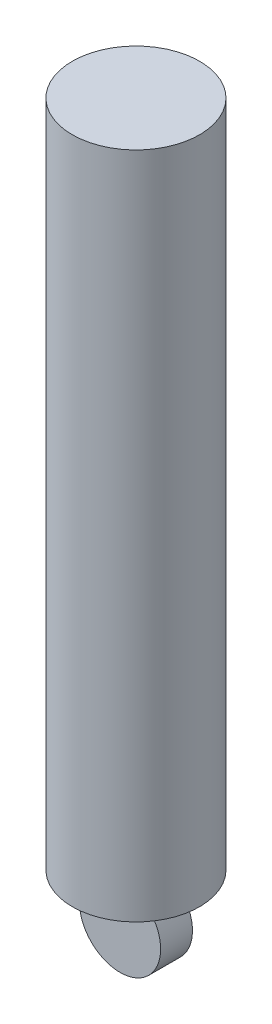
ISO-10303-21;
HEADER;
FILE_DESCRIPTION(('STEP AP214'),'2;1');
FILE_NAME('part.step','',(''),(''),'','','');
FILE_SCHEMA(('AUTOMOTIVE_DESIGN { 1 0 10303 214 1 1 1 1 }'));
ENDSEC;
DATA;
#1=APPLICATION_CONTEXT('core data for automotive mechanical design processes');
#2=APPLICATION_PROTOCOL_DEFINITION('international standard','automotive_design',2000,#1);
#3=PRODUCT_CONTEXT('',#1,'mechanical');
#4=PRODUCT('Part','Part','',(#3));
#5=PRODUCT_RELATED_PRODUCT_CATEGORY('part','',(#4));
#6=PRODUCT_DEFINITION_FORMATION('','',#4);
#7=PRODUCT_DEFINITION_CONTEXT('part definition',#1,'design');
#8=PRODUCT_DEFINITION('design','',#6,#7);
#9=PRODUCT_DEFINITION_SHAPE('','',#8);
#10=(LENGTH_UNIT() NAMED_UNIT(*) SI_UNIT(.MILLI.,.METRE.));
#11=(NAMED_UNIT(*) PLANE_ANGLE_UNIT() SI_UNIT($,.RADIAN.));
#12=(NAMED_UNIT(*) SI_UNIT($,.STERADIAN.) SOLID_ANGLE_UNIT());
#13=UNCERTAINTY_MEASURE_WITH_UNIT(LENGTH_MEASURE(1.E-05),#10,'distance_accuracy_value','');
#14=(GEOMETRIC_REPRESENTATION_CONTEXT(3) GLOBAL_UNCERTAINTY_ASSIGNED_CONTEXT((#13)) GLOBAL_UNIT_ASSIGNED_CONTEXT((#10,
#11,#12)) REPRESENTATION_CONTEXT('',''));
#15=CARTESIAN_POINT('',(0.,0.,0.));
#16=DIRECTION('',(0.,0.,1.));
#17=DIRECTION('',(1.,0.,0.));
#18=AXIS2_PLACEMENT_3D('',#15,#16,#17);
#19=CARTESIAN_POINT('',(0.,266.7,0.));
#20=DIRECTION('',(0.,-1.,0.));
#21=DIRECTION('',(0.,0.,-1.));
#22=AXIS2_PLACEMENT_3D('',#19,#20,#21);
#23=CYLINDRICAL_SURFACE('',#22,25.4);
#24=CARTESIAN_POINT('',(0.,266.7,0.));
#25=DIRECTION('',(0.,1.,0.));
#26=DIRECTION('',(0.,0.,1.));
#27=AXIS2_PLACEMENT_3D('',#24,#25,#26);
#28=CIRCLE('',#27,25.4);
#29=CARTESIAN_POINT('',(0.,266.7,25.4));
#30=VERTEX_POINT('',#29);
#31=EDGE_CURVE('E66',#30,#30,#28,.T.);
#32=ORIENTED_EDGE('',*,*,#31,.F.);
#33=EDGE_LOOP('',(#32));
#34=FACE_BOUND('',#33,.T.);
#35=CARTESIAN_POINT('',(0.,0.,0.));
#36=DIRECTION('',(0.,1.,0.));
#37=DIRECTION('',(0.,0.,1.));
#38=AXIS2_PLACEMENT_3D('',#35,#36,#37);
#39=CIRCLE('',#38,25.4);
#40=CARTESIAN_POINT('',(0.,0.,25.4));
#41=VERTEX_POINT('',#40);
#42=EDGE_CURVE('E71',#41,#41,#39,.T.);
#43=ORIENTED_EDGE('',*,*,#42,.T.);
#44=EDGE_LOOP('',(#43));
#45=FACE_BOUND('',#44,.T.);
#46=ADVANCED_FACE('F33',(#34,#45),#23,.T.);
#47=CARTESIAN_POINT('',(0.,266.7,0.));
#48=DIRECTION('',(0.,1.,0.));
#49=DIRECTION('',(0.,0.,1.));
#50=AXIS2_PLACEMENT_3D('',#47,#48,#49);
#51=PLANE('',#50);
#52=ORIENTED_EDGE('',*,*,#31,.T.);
#53=EDGE_LOOP('',(#52));
#54=FACE_BOUND('',#53,.T.);
#55=ADVANCED_FACE('F81',(#54),#51,.T.);
#56=CARTESIAN_POINT('',(0.,0.,0.));
#57=DIRECTION('',(0.,1.,0.));
#58=DIRECTION('',(0.,0.,1.));
#59=AXIS2_PLACEMENT_3D('',#56,#57,#58);
#60=PLANE('',#59);
#61=DIRECTION('',(0.,0.,-1.));
#62=VECTOR('',#61,1.);
#63=CARTESIAN_POINT('',(-2.25725391322138,0.,6.35));
#64=LINE('',#63,#62);
#65=CARTESIAN_POINT('',(-2.25725391322138,0.,6.35));
#66=VERTEX_POINT('',#65);
#67=CARTESIAN_POINT('',(-2.25725391322138,0.,-6.35));
#68=VERTEX_POINT('',#67);
#69=EDGE_CURVE('E50',#66,#68,#64,.T.);
#70=ORIENTED_EDGE('',*,*,#69,.F.);
#71=DIRECTION('',(1.,0.,0.));
#72=VECTOR('',#71,1.);
#73=CARTESIAN_POINT('',(0.,0.,6.35));
#74=LINE('',#73,#72);
#75=CARTESIAN_POINT('',(2.25725391322138,0.,6.35));
#76=VERTEX_POINT('',#75);
#77=EDGE_CURVE('E11',#66,#76,#74,.T.);
#78=ORIENTED_EDGE('',*,*,#77,.T.);
#79=DIRECTION('',(0.,0.,-1.));
#80=VECTOR('',#79,1.);
#81=CARTESIAN_POINT('',(2.25725391322138,0.,6.35));
#82=LINE('',#81,#80);
#83=CARTESIAN_POINT('',(2.25725391322138,0.,-6.35));
#84=VERTEX_POINT('',#83);
#85=EDGE_CURVE('E40',#84,#76,#82,.F.);
#86=ORIENTED_EDGE('',*,*,#85,.F.);
#87=DIRECTION('',(1.,0.,0.));
#88=VECTOR('',#87,1.);
#89=CARTESIAN_POINT('',(0.,0.,-6.35));
#90=LINE('',#89,#88);
#91=EDGE_CURVE('E57',#68,#84,#90,.T.);
#92=ORIENTED_EDGE('',*,*,#91,.F.);
#93=EDGE_LOOP('',(#70,#78,#86,#92));
#94=FACE_BOUND('',#93,.T.);
#95=ORIENTED_EDGE('',*,*,#42,.F.);
#96=EDGE_LOOP('',(#95));
#97=FACE_BOUND('',#96,.T.);
#98=ADVANCED_FACE('F55',(#94,#97),#60,.F.);
#99=CARTESIAN_POINT('',(0.,-16.0399674502827,6.35));
#100=DIRECTION('',(0.,0.,-1.));
#101=DIRECTION('',(-1.,0.,0.));
#102=AXIS2_PLACEMENT_3D('',#99,#100,#101);
#103=CYLINDRICAL_SURFACE('',#102,16.1980168858685);
#104=CARTESIAN_POINT('',(0.,-16.0399674502827,-6.35));
#105=DIRECTION('',(0.,0.,1.));
#106=DIRECTION('',(1.,0.,0.));
#107=AXIS2_PLACEMENT_3D('',#104,#105,#106);
#108=CIRCLE('',#107,16.1980168858685);
#109=EDGE_CURVE('E65',#68,#84,#108,.T.);
#110=ORIENTED_EDGE('',*,*,#109,.T.);
#111=ORIENTED_EDGE('',*,*,#85,.T.);
#112=CARTESIAN_POINT('',(0.,-16.0399674502827,6.35));
#113=DIRECTION('',(0.,0.,1.));
#114=DIRECTION('',(1.,0.,0.));
#115=AXIS2_PLACEMENT_3D('',#112,#113,#114);
#116=CIRCLE('',#115,16.1980168858685);
#117=EDGE_CURVE('E69',#66,#76,#116,.T.);
#118=ORIENTED_EDGE('',*,*,#117,.F.);
#119=ORIENTED_EDGE('',*,*,#69,.T.);
#120=EDGE_LOOP('',(#110,#111,#118,#119));
#121=FACE_BOUND('',#120,.T.);
#122=ADVANCED_FACE('F68',(#121),#103,.T.);
#123=CARTESIAN_POINT('',(0.,-16.0399674502827,6.35));
#124=DIRECTION('',(0.,0.,1.));
#125=DIRECTION('',(1.,0.,0.));
#126=AXIS2_PLACEMENT_3D('',#123,#124,#125);
#127=PLANE('',#126);
#128=ORIENTED_EDGE('',*,*,#77,.F.);
#129=ORIENTED_EDGE('',*,*,#117,.T.);
#130=EDGE_LOOP('',(#128,#129));
#131=FACE_BOUND('',#130,.T.);
#132=ADVANCED_FACE('F86',(#131),#127,.T.);
#133=CARTESIAN_POINT('',(0.,-16.0399674502827,-6.35));
#134=DIRECTION('',(0.,0.,1.));
#135=DIRECTION('',(1.,0.,0.));
#136=AXIS2_PLACEMENT_3D('',#133,#134,#135);
#137=PLANE('',#136);
#138=ORIENTED_EDGE('',*,*,#109,.F.);
#139=ORIENTED_EDGE('',*,*,#91,.T.);
#140=EDGE_LOOP('',(#138,#139));
#141=FACE_BOUND('',#140,.T.);
#142=ADVANCED_FACE('F64',(#141),#137,.F.);
#143=CLOSED_SHELL('',(#46,#55,#98,#122,#132,#142));
#144=MANIFOLD_SOLID_BREP('B2',#143);
#145=ADVANCED_BREP_SHAPE_REPRESENTATION('',(#18,#144),#14);
#146=SHAPE_DEFINITION_REPRESENTATION(#9,#145);
ENDSEC;
END-ISO-10303-21;
